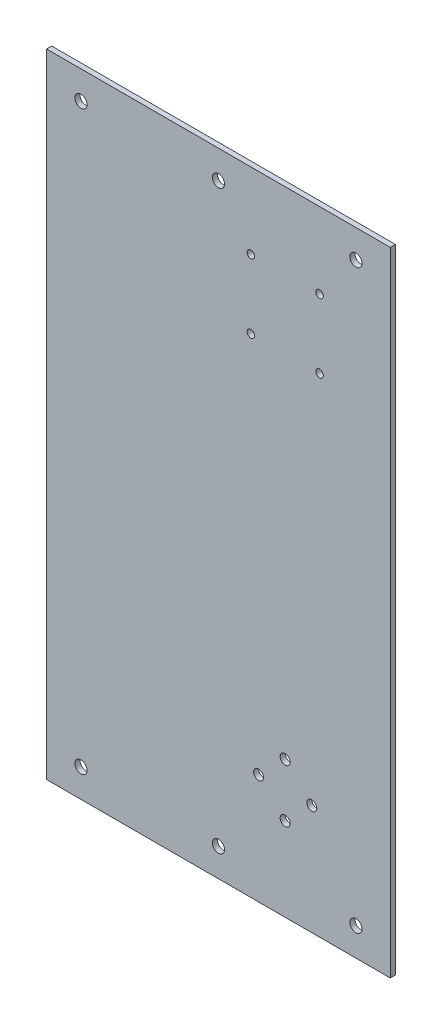
ISO-10303-21;
HEADER;
FILE_DESCRIPTION(('STEP AP214'),'2;1');
FILE_NAME('part.step','',(''),(''),'','','');
FILE_SCHEMA(('AUTOMOTIVE_DESIGN { 1 0 10303 214 1 1 1 1 }'));
ENDSEC;
DATA;
#1=APPLICATION_CONTEXT('core data for automotive mechanical design processes');
#2=APPLICATION_PROTOCOL_DEFINITION('international standard','automotive_design',2000,#1);
#3=PRODUCT_CONTEXT('',#1,'mechanical');
#4=PRODUCT('Part','Part','',(#3));
#5=PRODUCT_RELATED_PRODUCT_CATEGORY('part','',(#4));
#6=PRODUCT_DEFINITION_FORMATION('','',#4);
#7=PRODUCT_DEFINITION_CONTEXT('part definition',#1,'design');
#8=PRODUCT_DEFINITION('design','',#6,#7);
#9=PRODUCT_DEFINITION_SHAPE('','',#8);
#10=(LENGTH_UNIT() NAMED_UNIT(*) SI_UNIT(.MILLI.,.METRE.));
#11=(NAMED_UNIT(*) PLANE_ANGLE_UNIT() SI_UNIT($,.RADIAN.));
#12=(NAMED_UNIT(*) SI_UNIT($,.STERADIAN.) SOLID_ANGLE_UNIT());
#13=UNCERTAINTY_MEASURE_WITH_UNIT(LENGTH_MEASURE(1.E-05),#10,'distance_accuracy_value','');
#14=(GEOMETRIC_REPRESENTATION_CONTEXT(3) GLOBAL_UNCERTAINTY_ASSIGNED_CONTEXT((#13)) GLOBAL_UNIT_ASSIGNED_CONTEXT((#10,
#11,#12)) REPRESENTATION_CONTEXT('',''));
#15=CARTESIAN_POINT('',(0.,0.,0.));
#16=DIRECTION('',(0.,0.,1.));
#17=DIRECTION('',(1.,0.,0.));
#18=AXIS2_PLACEMENT_3D('',#15,#16,#17);
#19=CARTESIAN_POINT('',(77.5,142.695,2.305));
#20=DIRECTION('',(-1.,0.,0.));
#21=DIRECTION('',(0.,-1.,0.));
#22=AXIS2_PLACEMENT_3D('',#19,#20,#21);
#23=PLANE('',#22);
#24=DIRECTION('',(0.,1.,0.));
#25=VECTOR('',#24,1.);
#26=CARTESIAN_POINT('',(77.5,142.695,0.));
#27=LINE('',#26,#25);
#28=CARTESIAN_POINT('',(77.5,-142.695,0.));
#29=VERTEX_POINT('',#28);
#30=CARTESIAN_POINT('',(77.5,142.695,0.));
#31=VERTEX_POINT('',#30);
#32=EDGE_CURVE('E107',#29,#31,#27,.T.);
#33=ORIENTED_EDGE('',*,*,#32,.T.);
#34=DIRECTION('',(0.,0.,-1.));
#35=VECTOR('',#34,1.);
#36=CARTESIAN_POINT('',(77.5,142.695,2.305));
#37=LINE('',#36,#35);
#38=CARTESIAN_POINT('',(77.5,142.695,2.305));
#39=VERTEX_POINT('',#38);
#40=EDGE_CURVE('E11',#39,#31,#37,.T.);
#41=ORIENTED_EDGE('',*,*,#40,.F.);
#42=DIRECTION('',(0.,1.,0.));
#43=VECTOR('',#42,1.);
#44=CARTESIAN_POINT('',(77.5,142.695,2.305));
#45=LINE('',#44,#43);
#46=CARTESIAN_POINT('',(77.5,-142.695,2.305));
#47=VERTEX_POINT('',#46);
#48=EDGE_CURVE('E90',#47,#39,#45,.T.);
#49=ORIENTED_EDGE('',*,*,#48,.F.);
#50=DIRECTION('',(0.,0.,-1.));
#51=VECTOR('',#50,1.);
#52=CARTESIAN_POINT('',(77.5,-142.695,2.305));
#53=LINE('',#52,#51);
#54=EDGE_CURVE('E103',#47,#29,#53,.T.);
#55=ORIENTED_EDGE('',*,*,#54,.T.);
#56=EDGE_LOOP('',(#33,#41,#49,#55));
#57=FACE_BOUND('',#56,.T.);
#58=ADVANCED_FACE('F38',(#57),#23,.F.);
#59=CARTESIAN_POINT('',(-77.5,142.695,2.305));
#60=DIRECTION('',(0.,-1.,0.));
#61=DIRECTION('',(0.,0.,-1.));
#62=AXIS2_PLACEMENT_3D('',#59,#60,#61);
#63=PLANE('',#62);
#64=DIRECTION('',(-1.,0.,0.));
#65=VECTOR('',#64,1.);
#66=CARTESIAN_POINT('',(-77.5,142.695,0.));
#67=LINE('',#66,#65);
#68=CARTESIAN_POINT('',(-77.5,142.695,0.));
#69=VERTEX_POINT('',#68);
#70=EDGE_CURVE('E95',#31,#69,#67,.T.);
#71=ORIENTED_EDGE('',*,*,#70,.T.);
#72=DIRECTION('',(0.,0.,-1.));
#73=VECTOR('',#72,1.);
#74=CARTESIAN_POINT('',(-77.5,142.695,2.305));
#75=LINE('',#74,#73);
#76=CARTESIAN_POINT('',(-77.5,142.695,2.305));
#77=VERTEX_POINT('',#76);
#78=EDGE_CURVE('E47',#77,#69,#75,.T.);
#79=ORIENTED_EDGE('',*,*,#78,.F.);
#80=DIRECTION('',(-1.,0.,0.));
#81=VECTOR('',#80,1.);
#82=CARTESIAN_POINT('',(-77.5,142.695,2.305));
#83=LINE('',#82,#81);
#84=EDGE_CURVE('E85',#39,#77,#83,.T.);
#85=ORIENTED_EDGE('',*,*,#84,.F.);
#86=ORIENTED_EDGE('',*,*,#40,.T.);
#87=EDGE_LOOP('',(#71,#79,#85,#86));
#88=FACE_BOUND('',#87,.T.);
#89=ADVANCED_FACE('F94',(#88),#63,.F.);
#90=CARTESIAN_POINT('',(-77.5,142.695,2.305));
#91=DIRECTION('',(1.,0.,0.));
#92=DIRECTION('',(0.,1.,0.));
#93=AXIS2_PLACEMENT_3D('',#90,#91,#92);
#94=PLANE('',#93);
#95=DIRECTION('',(0.,-1.,0.));
#96=VECTOR('',#95,1.);
#97=CARTESIAN_POINT('',(-77.5,142.695,0.));
#98=LINE('',#97,#96);
#99=CARTESIAN_POINT('',(-77.5,-142.695,0.));
#100=VERTEX_POINT('',#99);
#101=EDGE_CURVE('E72',#69,#100,#98,.T.);
#102=ORIENTED_EDGE('',*,*,#101,.T.);
#103=DIRECTION('',(0.,0.,-1.));
#104=VECTOR('',#103,1.);
#105=CARTESIAN_POINT('',(-77.5,-142.695,2.305));
#106=LINE('',#105,#104);
#107=CARTESIAN_POINT('',(-77.5,-142.695,2.305));
#108=VERTEX_POINT('',#107);
#109=EDGE_CURVE('E97',#108,#100,#106,.T.);
#110=ORIENTED_EDGE('',*,*,#109,.F.);
#111=DIRECTION('',(0.,-1.,0.));
#112=VECTOR('',#111,1.);
#113=CARTESIAN_POINT('',(-77.5,142.695,2.305));
#114=LINE('',#113,#112);
#115=EDGE_CURVE('E88',#77,#108,#114,.T.);
#116=ORIENTED_EDGE('',*,*,#115,.F.);
#117=ORIENTED_EDGE('',*,*,#78,.T.);
#118=EDGE_LOOP('',(#102,#110,#116,#117));
#119=FACE_BOUND('',#118,.T.);
#120=ADVANCED_FACE('F98',(#119),#94,.F.);
#121=CARTESIAN_POINT('',(-77.5,-142.695,2.305));
#122=DIRECTION('',(0.,1.,0.));
#123=DIRECTION('',(0.,0.,1.));
#124=AXIS2_PLACEMENT_3D('',#121,#122,#123);
#125=PLANE('',#124);
#126=DIRECTION('',(1.,0.,0.));
#127=VECTOR('',#126,1.);
#128=CARTESIAN_POINT('',(-77.5,-142.695,0.));
#129=LINE('',#128,#127);
#130=EDGE_CURVE('E78',#100,#29,#129,.T.);
#131=ORIENTED_EDGE('',*,*,#130,.T.);
#132=ORIENTED_EDGE('',*,*,#54,.F.);
#133=DIRECTION('',(1.,0.,0.));
#134=VECTOR('',#133,1.);
#135=CARTESIAN_POINT('',(-77.5,-142.695,2.305));
#136=LINE('',#135,#134);
#137=EDGE_CURVE('E55',#108,#47,#136,.T.);
#138=ORIENTED_EDGE('',*,*,#137,.F.);
#139=ORIENTED_EDGE('',*,*,#109,.T.);
#140=EDGE_LOOP('',(#131,#132,#138,#139));
#141=FACE_BOUND('',#140,.T.);
#142=ADVANCED_FACE('F122',(#141),#125,.F.);
#143=CARTESIAN_POINT('',(0.,0.,2.305));
#144=DIRECTION('',(0.,0.,1.));
#145=DIRECTION('',(1.,0.,0.));
#146=AXIS2_PLACEMENT_3D('',#143,#144,#145);
#147=PLANE('',#146);
#148=CARTESIAN_POINT('',(62.,129.995,2.305));
#149=DIRECTION('',(0.,0.,1.));
#150=DIRECTION('',(1.,0.,0.));
#151=AXIS2_PLACEMENT_3D('',#148,#149,#150);
#152=CIRCLE('',#151,2.74999999999999);
#153=CARTESIAN_POINT('',(64.75,129.995,2.305));
#154=VERTEX_POINT('',#153);
#155=EDGE_CURVE('E237',#154,#154,#152,.T.);
#156=ORIENTED_EDGE('',*,*,#155,.F.);
#157=EDGE_LOOP('',(#156));
#158=FACE_BOUND('',#157,.T.);
#159=CARTESIAN_POINT('',(45.6,108.5,2.305));
#160=DIRECTION('',(0.,0.,1.));
#161=DIRECTION('',(1.,0.,0.));
#162=AXIS2_PLACEMENT_3D('',#159,#160,#161);
#163=CIRCLE('',#162,1.7);
#164=CARTESIAN_POINT('',(47.3,108.5,2.305));
#165=VERTEX_POINT('',#164);
#166=EDGE_CURVE('E194',#165,#165,#163,.T.);
#167=ORIENTED_EDGE('',*,*,#166,.F.);
#168=EDGE_LOOP('',(#167));
#169=FACE_BOUND('',#168,.T.);
#170=CARTESIAN_POINT('',(18.1,-92.9999999999999,2.305));
#171=DIRECTION('',(0.,0.,1.));
#172=DIRECTION('',(1.,0.,0.));
#173=AXIS2_PLACEMENT_3D('',#170,#171,#172);
#174=CIRCLE('',#173,2.25);
#175=CARTESIAN_POINT('',(20.35,-92.9999999999999,2.305));
#176=VERTEX_POINT('',#175);
#177=EDGE_CURVE('E203',#176,#176,#174,.T.);
#178=ORIENTED_EDGE('',*,*,#177,.F.);
#179=EDGE_LOOP('',(#178));
#180=FACE_BOUND('',#179,.T.);
#181=CARTESIAN_POINT('',(30.1,-105.,2.305));
#182=DIRECTION('',(0.,0.,1.));
#183=DIRECTION('',(1.,0.,0.));
#184=AXIS2_PLACEMENT_3D('',#181,#182,#183);
#185=CIRCLE('',#184,2.25);
#186=CARTESIAN_POINT('',(32.35,-105.,2.305));
#187=VERTEX_POINT('',#186);
#188=EDGE_CURVE('E178',#187,#187,#185,.T.);
#189=ORIENTED_EDGE('',*,*,#188,.F.);
#190=EDGE_LOOP('',(#189));
#191=FACE_BOUND('',#190,.T.);
#192=CARTESIAN_POINT('',(42.1,-92.9999999999999,2.305));
#193=DIRECTION('',(0.,0.,1.));
#194=DIRECTION('',(1.,0.,0.));
#195=AXIS2_PLACEMENT_3D('',#192,#193,#194);
#196=CIRCLE('',#195,2.25);
#197=CARTESIAN_POINT('',(44.35,-92.9999999999999,2.305));
#198=VERTEX_POINT('',#197);
#199=EDGE_CURVE('E187',#198,#198,#196,.T.);
#200=ORIENTED_EDGE('',*,*,#199,.F.);
#201=EDGE_LOOP('',(#200));
#202=FACE_BOUND('',#201,.T.);
#203=CARTESIAN_POINT('',(14.6,77.5,2.305));
#204=DIRECTION('',(0.,0.,1.));
#205=DIRECTION('',(1.,0.,0.));
#206=AXIS2_PLACEMENT_3D('',#203,#204,#205);
#207=CIRCLE('',#206,1.7);
#208=CARTESIAN_POINT('',(16.3,77.5,2.305));
#209=VERTEX_POINT('',#208);
#210=EDGE_CURVE('E227',#209,#209,#207,.T.);
#211=ORIENTED_EDGE('',*,*,#210,.F.);
#212=EDGE_LOOP('',(#211));
#213=FACE_BOUND('',#212,.T.);
#214=CARTESIAN_POINT('',(45.6,77.5,2.305));
#215=DIRECTION('',(0.,0.,1.));
#216=DIRECTION('',(1.,0.,0.));
#217=AXIS2_PLACEMENT_3D('',#214,#215,#216);
#218=CIRCLE('',#217,1.7);
#219=CARTESIAN_POINT('',(47.3,77.5,2.305));
#220=VERTEX_POINT('',#219);
#221=EDGE_CURVE('E219',#220,#220,#218,.T.);
#222=ORIENTED_EDGE('',*,*,#221,.F.);
#223=EDGE_LOOP('',(#222));
#224=FACE_BOUND('',#223,.T.);
#225=CARTESIAN_POINT('',(14.6,108.5,2.305));
#226=DIRECTION('',(0.,0.,1.));
#227=DIRECTION('',(1.,0.,0.));
#228=AXIS2_PLACEMENT_3D('',#225,#226,#227);
#229=CIRCLE('',#228,1.7);
#230=CARTESIAN_POINT('',(16.3,108.5,2.305));
#231=VERTEX_POINT('',#230);
#232=EDGE_CURVE('E210',#231,#231,#229,.T.);
#233=ORIENTED_EDGE('',*,*,#232,.F.);
#234=EDGE_LOOP('',(#233));
#235=FACE_BOUND('',#234,.T.);
#236=CARTESIAN_POINT('',(30.1,-80.9999999999999,2.305));
#237=DIRECTION('',(0.,0.,1.));
#238=DIRECTION('',(1.,0.,0.));
#239=AXIS2_PLACEMENT_3D('',#236,#237,#238);
#240=CIRCLE('',#239,2.25);
#241=CARTESIAN_POINT('',(32.35,-80.9999999999999,2.305));
#242=VERTEX_POINT('',#241);
#243=EDGE_CURVE('E170',#242,#242,#240,.T.);
#244=ORIENTED_EDGE('',*,*,#243,.F.);
#245=EDGE_LOOP('',(#244));
#246=FACE_BOUND('',#245,.T.);
#247=CARTESIAN_POINT('',(-62.,129.995,2.305));
#248=DIRECTION('',(0.,0.,1.));
#249=DIRECTION('',(1.,0.,0.));
#250=AXIS2_PLACEMENT_3D('',#247,#248,#249);
#251=CIRCLE('',#250,2.74999999999999);
#252=CARTESIAN_POINT('',(-59.25,129.995,2.305));
#253=VERTEX_POINT('',#252);
#254=EDGE_CURVE('E165',#253,#253,#251,.T.);
#255=ORIENTED_EDGE('',*,*,#254,.F.);
#256=EDGE_LOOP('',(#255));
#257=FACE_BOUND('',#256,.T.);
#258=CARTESIAN_POINT('',(0.,129.995,2.305));
#259=DIRECTION('',(0.,0.,1.));
#260=DIRECTION('',(1.,0.,0.));
#261=AXIS2_PLACEMENT_3D('',#258,#259,#260);
#262=CIRCLE('',#261,2.74999999999999);
#263=CARTESIAN_POINT('',(2.74999999999999,129.995,2.305));
#264=VERTEX_POINT('',#263);
#265=EDGE_CURVE('E157',#264,#264,#262,.T.);
#266=ORIENTED_EDGE('',*,*,#265,.F.);
#267=EDGE_LOOP('',(#266));
#268=FACE_BOUND('',#267,.T.);
#269=CARTESIAN_POINT('',(-62.,-129.995,2.305));
#270=DIRECTION('',(0.,0.,1.));
#271=DIRECTION('',(1.,0.,0.));
#272=AXIS2_PLACEMENT_3D('',#269,#270,#271);
#273=CIRCLE('',#272,2.74999999999999);
#274=CARTESIAN_POINT('',(-59.25,-129.995,2.305));
#275=VERTEX_POINT('',#274);
#276=EDGE_CURVE('E149',#275,#275,#273,.T.);
#277=ORIENTED_EDGE('',*,*,#276,.F.);
#278=EDGE_LOOP('',(#277));
#279=FACE_BOUND('',#278,.T.);
#280=CARTESIAN_POINT('',(0.,-129.995,2.305));
#281=DIRECTION('',(0.,0.,1.));
#282=DIRECTION('',(1.,0.,0.));
#283=AXIS2_PLACEMENT_3D('',#280,#281,#282);
#284=CIRCLE('',#283,2.74999999999999);
#285=CARTESIAN_POINT('',(2.74999999999999,-129.995,2.305));
#286=VERTEX_POINT('',#285);
#287=EDGE_CURVE('E141',#286,#286,#284,.T.);
#288=ORIENTED_EDGE('',*,*,#287,.F.);
#289=EDGE_LOOP('',(#288));
#290=FACE_BOUND('',#289,.T.);
#291=CARTESIAN_POINT('',(62.,-129.995,2.305));
#292=DIRECTION('',(0.,0.,1.));
#293=DIRECTION('',(1.,0.,0.));
#294=AXIS2_PLACEMENT_3D('',#291,#292,#293);
#295=CIRCLE('',#294,2.74999999999999);
#296=CARTESIAN_POINT('',(64.75,-129.995,2.305));
#297=VERTEX_POINT('',#296);
#298=EDGE_CURVE('E133',#297,#297,#295,.T.);
#299=ORIENTED_EDGE('',*,*,#298,.F.);
#300=EDGE_LOOP('',(#299));
#301=FACE_BOUND('',#300,.T.);
#302=ORIENTED_EDGE('',*,*,#48,.T.);
#303=ORIENTED_EDGE('',*,*,#84,.T.);
#304=ORIENTED_EDGE('',*,*,#115,.T.);
#305=ORIENTED_EDGE('',*,*,#137,.T.);
#306=EDGE_LOOP('',(#302,#303,#304,#305));
#307=FACE_BOUND('',#306,.T.);
#308=ADVANCED_FACE('F86',(#158,#169,#180,#191,#202,#213,#224,#235,#246,#257,#268,#279,#290,#301,
#307),#147,.T.);
#309=CARTESIAN_POINT('',(0.,0.,0.));
#310=DIRECTION('',(0.,0.,1.));
#311=DIRECTION('',(1.,0.,0.));
#312=AXIS2_PLACEMENT_3D('',#309,#310,#311);
#313=PLANE('',#312);
#314=CARTESIAN_POINT('',(62.,129.995,0.));
#315=DIRECTION('',(0.,0.,1.));
#316=DIRECTION('',(1.,0.,0.));
#317=AXIS2_PLACEMENT_3D('',#314,#315,#316);
#318=CIRCLE('',#317,2.75);
#319=CARTESIAN_POINT('',(64.75,129.995,0.));
#320=VERTEX_POINT('',#319);
#321=EDGE_CURVE('E215',#320,#320,#318,.T.);
#322=ORIENTED_EDGE('',*,*,#321,.T.);
#323=EDGE_LOOP('',(#322));
#324=FACE_BOUND('',#323,.T.);
#325=CARTESIAN_POINT('',(45.6,108.5,0.));
#326=DIRECTION('',(0.,0.,1.));
#327=DIRECTION('',(1.,0.,0.));
#328=AXIS2_PLACEMENT_3D('',#325,#326,#327);
#329=CIRCLE('',#328,1.7);
#330=CARTESIAN_POINT('',(47.3,108.5,0.));
#331=VERTEX_POINT('',#330);
#332=EDGE_CURVE('E198',#331,#331,#329,.T.);
#333=ORIENTED_EDGE('',*,*,#332,.T.);
#334=EDGE_LOOP('',(#333));
#335=FACE_BOUND('',#334,.T.);
#336=CARTESIAN_POINT('',(18.1,-92.9999999999999,0.));
#337=DIRECTION('',(0.,0.,1.));
#338=DIRECTION('',(1.,0.,0.));
#339=AXIS2_PLACEMENT_3D('',#336,#337,#338);
#340=CIRCLE('',#339,2.25);
#341=CARTESIAN_POINT('',(20.35,-92.9999999999999,0.));
#342=VERTEX_POINT('',#341);
#343=EDGE_CURVE('E183',#342,#342,#340,.T.);
#344=ORIENTED_EDGE('',*,*,#343,.T.);
#345=EDGE_LOOP('',(#344));
#346=FACE_BOUND('',#345,.T.);
#347=CARTESIAN_POINT('',(30.1,-105.,0.));
#348=DIRECTION('',(0.,0.,1.));
#349=DIRECTION('',(1.,0.,0.));
#350=AXIS2_PLACEMENT_3D('',#347,#348,#349);
#351=CIRCLE('',#350,2.25);
#352=CARTESIAN_POINT('',(32.35,-105.,0.));
#353=VERTEX_POINT('',#352);
#354=EDGE_CURVE('E182',#353,#353,#351,.T.);
#355=ORIENTED_EDGE('',*,*,#354,.T.);
#356=EDGE_LOOP('',(#355));
#357=FACE_BOUND('',#356,.T.);
#358=CARTESIAN_POINT('',(42.1,-92.9999999999999,0.));
#359=DIRECTION('',(0.,0.,1.));
#360=DIRECTION('',(1.,0.,0.));
#361=AXIS2_PLACEMENT_3D('',#358,#359,#360);
#362=CIRCLE('',#361,2.25);
#363=CARTESIAN_POINT('',(44.35,-92.9999999999999,0.));
#364=VERTEX_POINT('',#363);
#365=EDGE_CURVE('E174',#364,#364,#362,.T.);
#366=ORIENTED_EDGE('',*,*,#365,.T.);
#367=EDGE_LOOP('',(#366));
#368=FACE_BOUND('',#367,.T.);
#369=CARTESIAN_POINT('',(14.6,77.5,0.));
#370=DIRECTION('',(0.,0.,1.));
#371=DIRECTION('',(1.,0.,0.));
#372=AXIS2_PLACEMENT_3D('',#369,#370,#371);
#373=CIRCLE('',#372,1.7);
#374=CARTESIAN_POINT('',(16.3,77.5,0.));
#375=VERTEX_POINT('',#374);
#376=EDGE_CURVE('E199',#375,#375,#373,.T.);
#377=ORIENTED_EDGE('',*,*,#376,.T.);
#378=EDGE_LOOP('',(#377));
#379=FACE_BOUND('',#378,.T.);
#380=CARTESIAN_POINT('',(45.6,77.5,0.));
#381=DIRECTION('',(0.,0.,1.));
#382=DIRECTION('',(1.,0.,0.));
#383=AXIS2_PLACEMENT_3D('',#380,#381,#382);
#384=CIRCLE('',#383,1.7);
#385=CARTESIAN_POINT('',(47.3,77.5,0.));
#386=VERTEX_POINT('',#385);
#387=EDGE_CURVE('E223',#386,#386,#384,.T.);
#388=ORIENTED_EDGE('',*,*,#387,.T.);
#389=EDGE_LOOP('',(#388));
#390=FACE_BOUND('',#389,.T.);
#391=CARTESIAN_POINT('',(14.6,108.5,0.));
#392=DIRECTION('',(0.,0.,1.));
#393=DIRECTION('',(1.,0.,0.));
#394=AXIS2_PLACEMENT_3D('',#391,#392,#393);
#395=CIRCLE('',#394,1.7);
#396=CARTESIAN_POINT('',(16.3,108.5,0.));
#397=VERTEX_POINT('',#396);
#398=EDGE_CURVE('E214',#397,#397,#395,.T.);
#399=ORIENTED_EDGE('',*,*,#398,.T.);
#400=EDGE_LOOP('',(#399));
#401=FACE_BOUND('',#400,.T.);
#402=CARTESIAN_POINT('',(30.1,-80.9999999999999,0.));
#403=DIRECTION('',(0.,0.,1.));
#404=DIRECTION('',(1.,0.,0.));
#405=AXIS2_PLACEMENT_3D('',#402,#403,#404);
#406=CIRCLE('',#405,2.25);
#407=CARTESIAN_POINT('',(32.35,-80.9999999999999,0.));
#408=VERTEX_POINT('',#407);
#409=EDGE_CURVE('E169',#408,#408,#406,.T.);
#410=ORIENTED_EDGE('',*,*,#409,.T.);
#411=EDGE_LOOP('',(#410));
#412=FACE_BOUND('',#411,.T.);
#413=CARTESIAN_POINT('',(-62.,129.995,0.));
#414=DIRECTION('',(0.,0.,1.));
#415=DIRECTION('',(1.,0.,0.));
#416=AXIS2_PLACEMENT_3D('',#413,#414,#415);
#417=CIRCLE('',#416,2.75);
#418=CARTESIAN_POINT('',(-59.25,129.995,0.));
#419=VERTEX_POINT('',#418);
#420=EDGE_CURVE('E161',#419,#419,#417,.T.);
#421=ORIENTED_EDGE('',*,*,#420,.T.);
#422=EDGE_LOOP('',(#421));
#423=FACE_BOUND('',#422,.T.);
#424=CARTESIAN_POINT('',(0.,129.995,0.));
#425=DIRECTION('',(0.,0.,1.));
#426=DIRECTION('',(1.,0.,0.));
#427=AXIS2_PLACEMENT_3D('',#424,#425,#426);
#428=CIRCLE('',#427,2.75);
#429=CARTESIAN_POINT('',(2.75,129.995,0.));
#430=VERTEX_POINT('',#429);
#431=EDGE_CURVE('E153',#430,#430,#428,.T.);
#432=ORIENTED_EDGE('',*,*,#431,.T.);
#433=EDGE_LOOP('',(#432));
#434=FACE_BOUND('',#433,.T.);
#435=CARTESIAN_POINT('',(-62.,-129.995,0.));
#436=DIRECTION('',(0.,0.,1.));
#437=DIRECTION('',(1.,0.,0.));
#438=AXIS2_PLACEMENT_3D('',#435,#436,#437);
#439=CIRCLE('',#438,2.75);
#440=CARTESIAN_POINT('',(-59.25,-129.995,0.));
#441=VERTEX_POINT('',#440);
#442=EDGE_CURVE('E145',#441,#441,#439,.T.);
#443=ORIENTED_EDGE('',*,*,#442,.T.);
#444=EDGE_LOOP('',(#443));
#445=FACE_BOUND('',#444,.T.);
#446=CARTESIAN_POINT('',(0.,-129.995,0.));
#447=DIRECTION('',(0.,0.,1.));
#448=DIRECTION('',(1.,0.,0.));
#449=AXIS2_PLACEMENT_3D('',#446,#447,#448);
#450=CIRCLE('',#449,2.75);
#451=CARTESIAN_POINT('',(2.75,-129.995,0.));
#452=VERTEX_POINT('',#451);
#453=EDGE_CURVE('E137',#452,#452,#450,.T.);
#454=ORIENTED_EDGE('',*,*,#453,.T.);
#455=EDGE_LOOP('',(#454));
#456=FACE_BOUND('',#455,.T.);
#457=CARTESIAN_POINT('',(62.,-129.995,0.));
#458=DIRECTION('',(0.,0.,1.));
#459=DIRECTION('',(1.,0.,0.));
#460=AXIS2_PLACEMENT_3D('',#457,#458,#459);
#461=CIRCLE('',#460,2.75);
#462=CARTESIAN_POINT('',(64.75,-129.995,0.));
#463=VERTEX_POINT('',#462);
#464=EDGE_CURVE('E111',#463,#463,#461,.T.);
#465=ORIENTED_EDGE('',*,*,#464,.T.);
#466=EDGE_LOOP('',(#465));
#467=FACE_BOUND('',#466,.T.);
#468=ORIENTED_EDGE('',*,*,#32,.F.);
#469=ORIENTED_EDGE('',*,*,#130,.F.);
#470=ORIENTED_EDGE('',*,*,#101,.F.);
#471=ORIENTED_EDGE('',*,*,#70,.F.);
#472=EDGE_LOOP('',(#468,#469,#470,#471));
#473=FACE_BOUND('',#472,.T.);
#474=ADVANCED_FACE('F125',(#324,#335,#346,#357,#368,#379,#390,#401,#412,#423,#434,#445,#456,
#467,#473),#313,.F.);
#475=CARTESIAN_POINT('',(62.,-129.995,2.305));
#476=DIRECTION('',(0.,0.,1.));
#477=DIRECTION('',(1.,0.,0.));
#478=AXIS2_PLACEMENT_3D('',#475,#476,#477);
#479=CYLINDRICAL_SURFACE('',#478,2.75);
#480=ORIENTED_EDGE('',*,*,#464,.F.);
#481=EDGE_LOOP('',(#480));
#482=FACE_BOUND('',#481,.T.);
#483=ORIENTED_EDGE('',*,*,#298,.T.);
#484=EDGE_LOOP('',(#483));
#485=FACE_BOUND('',#484,.T.);
#486=ADVANCED_FACE('F274',(#482,#485),#479,.F.);
#487=CARTESIAN_POINT('',(0.,-129.995,2.305));
#488=DIRECTION('',(0.,0.,1.));
#489=DIRECTION('',(1.,0.,0.));
#490=AXIS2_PLACEMENT_3D('',#487,#488,#489);
#491=CYLINDRICAL_SURFACE('',#490,2.74999999999999);
#492=ORIENTED_EDGE('',*,*,#453,.F.);
#493=EDGE_LOOP('',(#492));
#494=FACE_BOUND('',#493,.T.);
#495=ORIENTED_EDGE('',*,*,#287,.T.);
#496=EDGE_LOOP('',(#495));
#497=FACE_BOUND('',#496,.T.);
#498=ADVANCED_FACE('F276',(#494,#497),#491,.F.);
#499=CARTESIAN_POINT('',(-62.,-129.995,2.305));
#500=DIRECTION('',(0.,0.,1.));
#501=DIRECTION('',(1.,0.,0.));
#502=AXIS2_PLACEMENT_3D('',#499,#500,#501);
#503=CYLINDRICAL_SURFACE('',#502,2.75);
#504=ORIENTED_EDGE('',*,*,#442,.F.);
#505=EDGE_LOOP('',(#504));
#506=FACE_BOUND('',#505,.T.);
#507=ORIENTED_EDGE('',*,*,#276,.T.);
#508=EDGE_LOOP('',(#507));
#509=FACE_BOUND('',#508,.T.);
#510=ADVANCED_FACE('F283',(#506,#509),#503,.F.);
#511=CARTESIAN_POINT('',(0.,129.995,2.305));
#512=DIRECTION('',(0.,0.,1.));
#513=DIRECTION('',(1.,0.,0.));
#514=AXIS2_PLACEMENT_3D('',#511,#512,#513);
#515=CYLINDRICAL_SURFACE('',#514,2.74999999999999);
#516=ORIENTED_EDGE('',*,*,#431,.F.);
#517=EDGE_LOOP('',(#516));
#518=FACE_BOUND('',#517,.T.);
#519=ORIENTED_EDGE('',*,*,#265,.T.);
#520=EDGE_LOOP('',(#519));
#521=FACE_BOUND('',#520,.T.);
#522=ADVANCED_FACE('F331',(#518,#521),#515,.F.);
#523=CARTESIAN_POINT('',(-62.,129.995,2.305));
#524=DIRECTION('',(0.,0.,1.));
#525=DIRECTION('',(1.,0.,0.));
#526=AXIS2_PLACEMENT_3D('',#523,#524,#525);
#527=CYLINDRICAL_SURFACE('',#526,2.75);
#528=ORIENTED_EDGE('',*,*,#420,.F.);
#529=EDGE_LOOP('',(#528));
#530=FACE_BOUND('',#529,.T.);
#531=ORIENTED_EDGE('',*,*,#254,.T.);
#532=EDGE_LOOP('',(#531));
#533=FACE_BOUND('',#532,.T.);
#534=ADVANCED_FACE('F341',(#530,#533),#527,.F.);
#535=CARTESIAN_POINT('',(30.1,-80.9999999999999,0.));
#536=DIRECTION('',(0.,0.,1.));
#537=DIRECTION('',(1.,0.,0.));
#538=AXIS2_PLACEMENT_3D('',#535,#536,#537);
#539=CYLINDRICAL_SURFACE('',#538,2.25);
#540=ORIENTED_EDGE('',*,*,#409,.F.);
#541=EDGE_LOOP('',(#540));
#542=FACE_BOUND('',#541,.T.);
#543=ORIENTED_EDGE('',*,*,#243,.T.);
#544=EDGE_LOOP('',(#543));
#545=FACE_BOUND('',#544,.T.);
#546=ADVANCED_FACE('F351',(#542,#545),#539,.F.);
#547=CARTESIAN_POINT('',(14.6,108.5,0.));
#548=DIRECTION('',(0.,0.,1.));
#549=DIRECTION('',(1.,0.,0.));
#550=AXIS2_PLACEMENT_3D('',#547,#548,#549);
#551=CYLINDRICAL_SURFACE('',#550,1.7);
#552=ORIENTED_EDGE('',*,*,#398,.F.);
#553=EDGE_LOOP('',(#552));
#554=FACE_BOUND('',#553,.T.);
#555=ORIENTED_EDGE('',*,*,#232,.T.);
#556=EDGE_LOOP('',(#555));
#557=FACE_BOUND('',#556,.T.);
#558=ADVANCED_FACE('F361',(#554,#557),#551,.F.);
#559=CARTESIAN_POINT('',(45.6,77.5,0.));
#560=DIRECTION('',(0.,0.,1.));
#561=DIRECTION('',(1.,0.,0.));
#562=AXIS2_PLACEMENT_3D('',#559,#560,#561);
#563=CYLINDRICAL_SURFACE('',#562,1.7);
#564=ORIENTED_EDGE('',*,*,#387,.F.);
#565=EDGE_LOOP('',(#564));
#566=FACE_BOUND('',#565,.T.);
#567=ORIENTED_EDGE('',*,*,#221,.T.);
#568=EDGE_LOOP('',(#567));
#569=FACE_BOUND('',#568,.T.);
#570=ADVANCED_FACE('F371',(#566,#569),#563,.F.);
#571=CARTESIAN_POINT('',(14.6,77.5,0.));
#572=DIRECTION('',(0.,0.,1.));
#573=DIRECTION('',(1.,0.,0.));
#574=AXIS2_PLACEMENT_3D('',#571,#572,#573);
#575=CYLINDRICAL_SURFACE('',#574,1.7);
#576=ORIENTED_EDGE('',*,*,#376,.F.);
#577=EDGE_LOOP('',(#576));
#578=FACE_BOUND('',#577,.T.);
#579=ORIENTED_EDGE('',*,*,#210,.T.);
#580=EDGE_LOOP('',(#579));
#581=FACE_BOUND('',#580,.T.);
#582=ADVANCED_FACE('F381',(#578,#581),#575,.F.);
#583=CARTESIAN_POINT('',(42.1,-92.9999999999999,0.));
#584=DIRECTION('',(0.,0.,1.));
#585=DIRECTION('',(1.,0.,0.));
#586=AXIS2_PLACEMENT_3D('',#583,#584,#585);
#587=CYLINDRICAL_SURFACE('',#586,2.25);
#588=ORIENTED_EDGE('',*,*,#365,.F.);
#589=EDGE_LOOP('',(#588));
#590=FACE_BOUND('',#589,.T.);
#591=ORIENTED_EDGE('',*,*,#199,.T.);
#592=EDGE_LOOP('',(#591));
#593=FACE_BOUND('',#592,.T.);
#594=ADVANCED_FACE('F391',(#590,#593),#587,.F.);
#595=CARTESIAN_POINT('',(30.1,-105.,0.));
#596=DIRECTION('',(0.,0.,1.));
#597=DIRECTION('',(1.,0.,0.));
#598=AXIS2_PLACEMENT_3D('',#595,#596,#597);
#599=CYLINDRICAL_SURFACE('',#598,2.25);
#600=ORIENTED_EDGE('',*,*,#354,.F.);
#601=EDGE_LOOP('',(#600));
#602=FACE_BOUND('',#601,.T.);
#603=ORIENTED_EDGE('',*,*,#188,.T.);
#604=EDGE_LOOP('',(#603));
#605=FACE_BOUND('',#604,.T.);
#606=ADVANCED_FACE('F401',(#602,#605),#599,.F.);
#607=CARTESIAN_POINT('',(18.1,-92.9999999999999,0.));
#608=DIRECTION('',(0.,0.,1.));
#609=DIRECTION('',(1.,0.,0.));
#610=AXIS2_PLACEMENT_3D('',#607,#608,#609);
#611=CYLINDRICAL_SURFACE('',#610,2.25);
#612=ORIENTED_EDGE('',*,*,#343,.F.);
#613=EDGE_LOOP('',(#612));
#614=FACE_BOUND('',#613,.T.);
#615=ORIENTED_EDGE('',*,*,#177,.T.);
#616=EDGE_LOOP('',(#615));
#617=FACE_BOUND('',#616,.T.);
#618=ADVANCED_FACE('F411',(#614,#617),#611,.F.);
#619=CARTESIAN_POINT('',(45.6,108.5,0.));
#620=DIRECTION('',(0.,0.,1.));
#621=DIRECTION('',(1.,0.,0.));
#622=AXIS2_PLACEMENT_3D('',#619,#620,#621);
#623=CYLINDRICAL_SURFACE('',#622,1.7);
#624=ORIENTED_EDGE('',*,*,#332,.F.);
#625=EDGE_LOOP('',(#624));
#626=FACE_BOUND('',#625,.T.);
#627=ORIENTED_EDGE('',*,*,#166,.T.);
#628=EDGE_LOOP('',(#627));
#629=FACE_BOUND('',#628,.T.);
#630=ADVANCED_FACE('F421',(#626,#629),#623,.F.);
#631=CARTESIAN_POINT('',(62.,129.995,2.305));
#632=DIRECTION('',(0.,0.,1.));
#633=DIRECTION('',(1.,0.,0.));
#634=AXIS2_PLACEMENT_3D('',#631,#632,#633);
#635=CYLINDRICAL_SURFACE('',#634,2.75);
#636=ORIENTED_EDGE('',*,*,#321,.F.);
#637=EDGE_LOOP('',(#636));
#638=FACE_BOUND('',#637,.T.);
#639=ORIENTED_EDGE('',*,*,#155,.T.);
#640=EDGE_LOOP('',(#639));
#641=FACE_BOUND('',#640,.T.);
#642=ADVANCED_FACE('F243',(#638,#641),#635,.F.);
#643=CLOSED_SHELL('',(#58,#89,#120,#142,#308,#474,#486,#498,#510,#522,#534,#546,#558,#570,#582,
#594,#606,#618,#630,#642));
#644=MANIFOLD_SOLID_BREP('B2',#643);
#645=ADVANCED_BREP_SHAPE_REPRESENTATION('',(#18,#644),#14);
#646=SHAPE_DEFINITION_REPRESENTATION(#9,#645);
ENDSEC;
END-ISO-10303-21;
